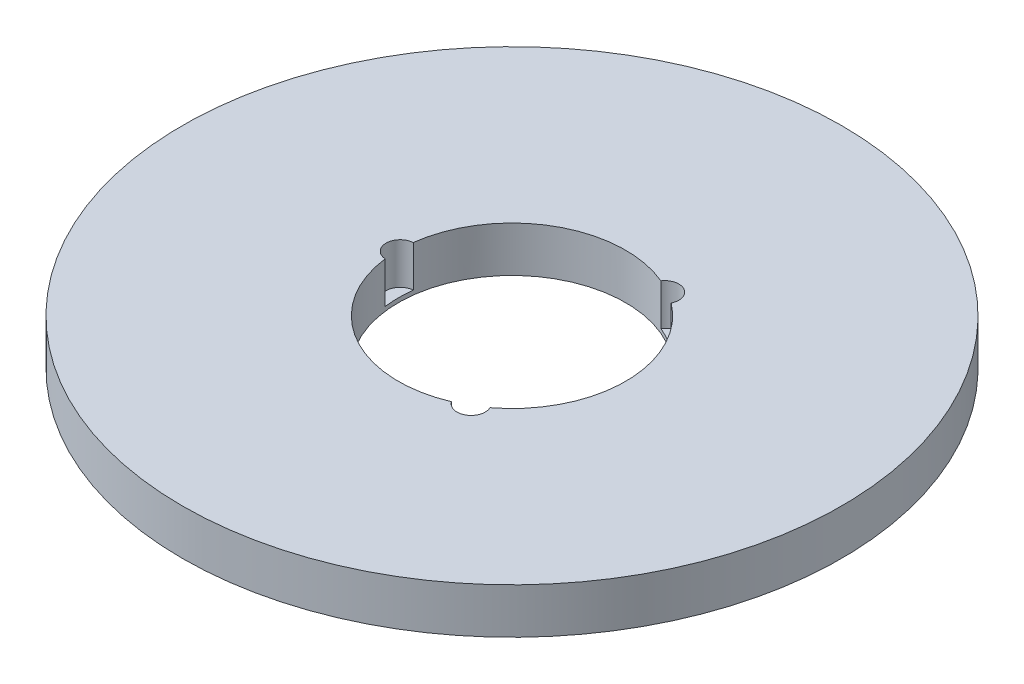
ISO-10303-21;
HEADER;
FILE_DESCRIPTION(('STEP AP214'),'2;1');
FILE_NAME('part.step','',(''),(''),'','','');
FILE_SCHEMA(('AUTOMOTIVE_DESIGN { 1 0 10303 214 1 1 1 1 }'));
ENDSEC;
DATA;
#1=APPLICATION_CONTEXT('core data for automotive mechanical design processes');
#2=APPLICATION_PROTOCOL_DEFINITION('international standard','automotive_design',2000,#1);
#3=PRODUCT_CONTEXT('',#1,'mechanical');
#4=PRODUCT('Part','Part','',(#3));
#5=PRODUCT_RELATED_PRODUCT_CATEGORY('part','',(#4));
#6=PRODUCT_DEFINITION_FORMATION('','',#4);
#7=PRODUCT_DEFINITION_CONTEXT('part definition',#1,'design');
#8=PRODUCT_DEFINITION('design','',#6,#7);
#9=PRODUCT_DEFINITION_SHAPE('','',#8);
#10=(LENGTH_UNIT() NAMED_UNIT(*) SI_UNIT(.MILLI.,.METRE.));
#11=(NAMED_UNIT(*) PLANE_ANGLE_UNIT() SI_UNIT($,.RADIAN.));
#12=(NAMED_UNIT(*) SI_UNIT($,.STERADIAN.) SOLID_ANGLE_UNIT());
#13=UNCERTAINTY_MEASURE_WITH_UNIT(LENGTH_MEASURE(1.E-05),#10,'distance_accuracy_value','');
#14=(GEOMETRIC_REPRESENTATION_CONTEXT(3) GLOBAL_UNCERTAINTY_ASSIGNED_CONTEXT((#13)) GLOBAL_UNIT_ASSIGNED_CONTEXT((#10,
#11,#12)) REPRESENTATION_CONTEXT('',''));
#15=CARTESIAN_POINT('',(0.,0.,0.));
#16=DIRECTION('',(0.,0.,1.));
#17=DIRECTION('',(1.,0.,0.));
#18=AXIS2_PLACEMENT_3D('',#15,#16,#17);
#19=CARTESIAN_POINT('',(0.,10.,0.));
#20=DIRECTION('',(0.,-1.,0.));
#21=DIRECTION('',(0.,0.,-1.));
#22=AXIS2_PLACEMENT_3D('',#19,#20,#21);
#23=CYLINDRICAL_SURFACE('',#22,72.5);
#24=CARTESIAN_POINT('',(0.,10.,0.));
#25=DIRECTION('',(0.,1.,0.));
#26=DIRECTION('',(0.,0.,1.));
#27=AXIS2_PLACEMENT_3D('',#24,#25,#26);
#28=CIRCLE('',#27,72.5);
#29=CARTESIAN_POINT('',(0.,10.,72.5));
#30=VERTEX_POINT('',#29);
#31=EDGE_CURVE('E130',#30,#30,#28,.T.);
#32=ORIENTED_EDGE('',*,*,#31,.F.);
#33=EDGE_LOOP('',(#32));
#34=FACE_BOUND('',#33,.T.);
#35=CARTESIAN_POINT('',(0.,0.,0.));
#36=DIRECTION('',(0.,1.,0.));
#37=DIRECTION('',(0.,0.,1.));
#38=AXIS2_PLACEMENT_3D('',#35,#36,#37);
#39=CIRCLE('',#38,72.5);
#40=CARTESIAN_POINT('',(0.,0.,72.5));
#41=VERTEX_POINT('',#40);
#42=EDGE_CURVE('E117',#41,#41,#39,.T.);
#43=ORIENTED_EDGE('',*,*,#42,.T.);
#44=EDGE_LOOP('',(#43));
#45=FACE_BOUND('',#44,.T.);
#46=ADVANCED_FACE('F39',(#34,#45),#23,.T.);
#47=CARTESIAN_POINT('',(0.,10.,0.));
#48=DIRECTION('',(0.,1.,0.));
#49=DIRECTION('',(0.,0.,1.));
#50=AXIS2_PLACEMENT_3D('',#47,#48,#49);
#51=PLANE('',#50);
#52=CARTESIAN_POINT('',(12.295118006902,10.,21.295769073009));
#53=DIRECTION('',(0.,1.,0.));
#54=DIRECTION('',(0.866025403784436,0.,-0.500000000000004));
#55=AXIS2_PLACEMENT_3D('',#52,#53,#54);
#56=CIRCLE('',#55,3.10738609465101);
#57=CARTESIAN_POINT('',(9.7190245812546,10.,23.0334661132225));
#58=VERTEX_POINT('',#57);
#59=CARTESIAN_POINT('',(15.0880545006316,10.,19.933655243983));
#60=VERTEX_POINT('',#59);
#61=EDGE_CURVE('E148',#58,#60,#56,.T.);
#62=ORIENTED_EDGE('',*,*,#61,.F.);
#63=CARTESIAN_POINT('',(0.,10.,0.));
#64=DIRECTION('',(0.,1.,0.));
#65=DIRECTION('',(0.,0.,1.));
#66=AXIS2_PLACEMENT_3D('',#63,#64,#65);
#67=CIRCLE('',#66,25.);
#68=CARTESIAN_POINT('',(-24.807079081886,10.,3.09981086923947));
#69=VERTEX_POINT('',#68);
#70=EDGE_CURVE('E113',#69,#58,#67,.T.);
#71=ORIENTED_EDGE('',*,*,#70,.F.);
#72=CARTESIAN_POINT('',(-24.5902360138038,10.,0.));
#73=DIRECTION('',(0.,1.,0.));
#74=DIRECTION('',(0.,0.,1.));
#75=AXIS2_PLACEMENT_3D('',#72,#73,#74);
#76=CIRCLE('',#75,3.10738609465101);
#77=CARTESIAN_POINT('',(-24.807079081886,10.,-3.09981086923947));
#78=VERTEX_POINT('',#77);
#79=EDGE_CURVE('E125',#78,#69,#76,.T.);
#80=ORIENTED_EDGE('',*,*,#79,.F.);
#81=CARTESIAN_POINT('',(9.71902458125427,10.,-23.0334661132226));
#82=VERTEX_POINT('',#81);
#83=EDGE_CURVE('E107',#82,#78,#67,.T.);
#84=ORIENTED_EDGE('',*,*,#83,.F.);
#85=CARTESIAN_POINT('',(12.2951180069017,10.,-21.2957690730092));
#86=DIRECTION('',(0.,1.,0.));
#87=DIRECTION('',(-0.866025403784443,0.,-0.499999999999992));
#88=AXIS2_PLACEMENT_3D('',#85,#86,#87);
#89=CIRCLE('',#88,3.10738609465101);
#90=CARTESIAN_POINT('',(15.0880545006313,10.,-19.9336552439832));
#91=VERTEX_POINT('',#90);
#92=EDGE_CURVE('E95',#91,#82,#89,.T.);
#93=ORIENTED_EDGE('',*,*,#92,.F.);
#94=EDGE_CURVE('E106',#60,#91,#67,.T.);
#95=ORIENTED_EDGE('',*,*,#94,.F.);
#96=EDGE_LOOP('',(#62,#71,#80,#84,#93,#95));
#97=FACE_BOUND('',#96,.T.);
#98=ORIENTED_EDGE('',*,*,#31,.T.);
#99=EDGE_LOOP('',(#98));
#100=FACE_BOUND('',#99,.T.);
#101=ADVANCED_FACE('F102',(#97,#100),#51,.T.);
#102=CARTESIAN_POINT('',(0.,0.,0.));
#103=DIRECTION('',(0.,1.,0.));
#104=DIRECTION('',(0.,0.,1.));
#105=AXIS2_PLACEMENT_3D('',#102,#103,#104);
#106=PLANE('',#105);
#107=CARTESIAN_POINT('',(0.,0.,0.));
#108=DIRECTION('',(0.,1.,0.));
#109=DIRECTION('',(0.,0.,1.));
#110=AXIS2_PLACEMENT_3D('',#107,#108,#109);
#111=CIRCLE('',#110,25.);
#112=CARTESIAN_POINT('',(0.,0.,25.));
#113=VERTEX_POINT('',#112);
#114=EDGE_CURVE('E118',#113,#113,#111,.T.);
#115=ORIENTED_EDGE('',*,*,#114,.T.);
#116=EDGE_LOOP('',(#115));
#117=FACE_BOUND('',#116,.T.);
#118=ORIENTED_EDGE('',*,*,#42,.F.);
#119=EDGE_LOOP('',(#118));
#120=FACE_BOUND('',#119,.T.);
#121=ADVANCED_FACE('F161',(#117,#120),#106,.F.);
#122=CARTESIAN_POINT('',(0.,10.,0.));
#123=DIRECTION('',(0.,-1.,0.));
#124=DIRECTION('',(0.,0.,-1.));
#125=AXIS2_PLACEMENT_3D('',#122,#123,#124);
#126=CYLINDRICAL_SURFACE('',#125,25.);
#127=DIRECTION('',(0.,1.,0.));
#128=VECTOR('',#127,1.);
#129=CARTESIAN_POINT('',(9.71902458125459,5.46245991660253,23.0334661132225));
#130=LINE('',#129,#128);
#131=CARTESIAN_POINT('',(9.7190245812546,0.924919833205069,23.0334661132225));
#132=VERTEX_POINT('',#131);
#133=EDGE_CURVE('E11',#132,#58,#130,.T.);
#134=ORIENTED_EDGE('',*,*,#133,.F.);
#135=CARTESIAN_POINT('',(0.,0.924919833205069,0.));
#136=DIRECTION('',(0.,1.,0.));
#137=DIRECTION('',(0.,0.,1.));
#138=AXIS2_PLACEMENT_3D('',#135,#136,#137);
#139=CIRCLE('',#138,25.);
#140=CARTESIAN_POINT('',(15.0880545006316,0.924919833205069,19.933655243983));
#141=VERTEX_POINT('',#140);
#142=EDGE_CURVE('E100',#132,#141,#139,.T.);
#143=ORIENTED_EDGE('',*,*,#142,.T.);
#144=DIRECTION('',(0.,1.,0.));
#145=VECTOR('',#144,1.);
#146=CARTESIAN_POINT('',(15.0880545006316,5.46245991660253,19.933655243983));
#147=LINE('',#146,#145);
#148=EDGE_CURVE('E46',#60,#141,#147,.F.);
#149=ORIENTED_EDGE('',*,*,#148,.F.);
#150=ORIENTED_EDGE('',*,*,#94,.T.);
#151=DIRECTION('',(0.,1.,0.));
#152=VECTOR('',#151,1.);
#153=CARTESIAN_POINT('',(15.0880545006313,5.46245991660253,-19.9336552439832));
#154=LINE('',#153,#152);
#155=CARTESIAN_POINT('',(15.0880545006313,0.924919833205069,-19.9336552439832));
#156=VERTEX_POINT('',#155);
#157=EDGE_CURVE('E90',#156,#91,#154,.T.);
#158=ORIENTED_EDGE('',*,*,#157,.F.);
#159=CARTESIAN_POINT('',(0.,0.924919833205069,0.));
#160=DIRECTION('',(0.,1.,0.));
#161=DIRECTION('',(0.,0.,1.));
#162=AXIS2_PLACEMENT_3D('',#159,#160,#161);
#163=CIRCLE('',#162,25.);
#164=CARTESIAN_POINT('',(9.71902458125427,0.924919833205069,-23.0334661132226));
#165=VERTEX_POINT('',#164);
#166=EDGE_CURVE('E143',#156,#165,#163,.T.);
#167=ORIENTED_EDGE('',*,*,#166,.T.);
#168=DIRECTION('',(0.,1.,0.));
#169=VECTOR('',#168,1.);
#170=CARTESIAN_POINT('',(9.71902458125427,5.46245991660253,-23.0334661132226));
#171=LINE('',#170,#169);
#172=EDGE_CURVE('E98',#82,#165,#171,.F.);
#173=ORIENTED_EDGE('',*,*,#172,.F.);
#174=ORIENTED_EDGE('',*,*,#83,.T.);
#175=DIRECTION('',(0.,1.,0.));
#176=VECTOR('',#175,1.);
#177=CARTESIAN_POINT('',(-24.807079081886,5.46245991660253,-3.09981086923947));
#178=LINE('',#177,#176);
#179=CARTESIAN_POINT('',(-24.807079081886,0.924919833205069,-3.09981086923947));
#180=VERTEX_POINT('',#179);
#181=EDGE_CURVE('E137',#180,#78,#178,.T.);
#182=ORIENTED_EDGE('',*,*,#181,.F.);
#183=CARTESIAN_POINT('',(0.,0.924919833205069,0.));
#184=DIRECTION('',(0.,1.,0.));
#185=DIRECTION('',(0.,0.,1.));
#186=AXIS2_PLACEMENT_3D('',#183,#184,#185);
#187=CIRCLE('',#186,25.);
#188=CARTESIAN_POINT('',(-24.807079081886,0.924919833205069,3.09981086923947));
#189=VERTEX_POINT('',#188);
#190=EDGE_CURVE('E128',#180,#189,#187,.T.);
#191=ORIENTED_EDGE('',*,*,#190,.T.);
#192=DIRECTION('',(0.,1.,0.));
#193=VECTOR('',#192,1.);
#194=CARTESIAN_POINT('',(-24.807079081886,5.46245991660253,3.09981086923947));
#195=LINE('',#194,#193);
#196=EDGE_CURVE('E134',#69,#189,#195,.F.);
#197=ORIENTED_EDGE('',*,*,#196,.F.);
#198=ORIENTED_EDGE('',*,*,#70,.T.);
#199=EDGE_LOOP('',(#134,#143,#149,#150,#158,#167,#173,#174,#182,#191,#197,#198));
#200=FACE_BOUND('',#199,.T.);
#201=ORIENTED_EDGE('',*,*,#114,.F.);
#202=EDGE_LOOP('',(#201));
#203=FACE_BOUND('',#202,.T.);
#204=ADVANCED_FACE('F115',(#200,#203),#126,.F.);
#205=CARTESIAN_POINT('',(-24.5902360138038,0.924919833205069,0.));
#206=DIRECTION('',(0.,1.,0.));
#207=DIRECTION('',(0.,0.,1.));
#208=AXIS2_PLACEMENT_3D('',#205,#206,#207);
#209=CYLINDRICAL_SURFACE('',#208,3.10738609465101);
#210=ORIENTED_EDGE('',*,*,#181,.T.);
#211=ORIENTED_EDGE('',*,*,#79,.T.);
#212=ORIENTED_EDGE('',*,*,#196,.T.);
#213=CARTESIAN_POINT('',(-24.5902360138038,0.924919833205069,0.));
#214=DIRECTION('',(0.,1.,0.));
#215=DIRECTION('',(0.,0.,1.));
#216=AXIS2_PLACEMENT_3D('',#213,#214,#215);
#217=CIRCLE('',#216,3.10738609465101);
#218=EDGE_CURVE('E127',#180,#189,#217,.T.);
#219=ORIENTED_EDGE('',*,*,#218,.F.);
#220=EDGE_LOOP('',(#210,#211,#212,#219));
#221=FACE_BOUND('',#220,.T.);
#222=ADVANCED_FACE('F175',(#221),#209,.F.);
#223=CARTESIAN_POINT('',(-24.5902360138038,0.924919833205069,0.));
#224=DIRECTION('',(0.,1.,0.));
#225=DIRECTION('',(0.,0.,1.));
#226=AXIS2_PLACEMENT_3D('',#223,#224,#225);
#227=PLANE('',#226);
#228=ORIENTED_EDGE('',*,*,#218,.T.);
#229=ORIENTED_EDGE('',*,*,#190,.F.);
#230=EDGE_LOOP('',(#228,#229));
#231=FACE_BOUND('',#230,.T.);
#232=ADVANCED_FACE('F176',(#231),#227,.T.);
#233=CARTESIAN_POINT('',(12.2951180069017,0.924919833205069,-21.2957690730092));
#234=DIRECTION('',(0.,1.,0.));
#235=DIRECTION('',(0.,0.,1.));
#236=AXIS2_PLACEMENT_3D('',#233,#234,#235);
#237=CYLINDRICAL_SURFACE('',#236,3.10738609465101);
#238=ORIENTED_EDGE('',*,*,#157,.T.);
#239=ORIENTED_EDGE('',*,*,#92,.T.);
#240=ORIENTED_EDGE('',*,*,#172,.T.);
#241=CARTESIAN_POINT('',(12.2951180069017,0.924919833205069,-21.2957690730092));
#242=DIRECTION('',(0.,1.,0.));
#243=DIRECTION('',(-0.866025403784443,0.,-0.499999999999992));
#244=AXIS2_PLACEMENT_3D('',#241,#242,#243);
#245=CIRCLE('',#244,3.10738609465101);
#246=EDGE_CURVE('E56',#156,#165,#245,.T.);
#247=ORIENTED_EDGE('',*,*,#246,.F.);
#248=EDGE_LOOP('',(#238,#239,#240,#247));
#249=FACE_BOUND('',#248,.T.);
#250=ADVANCED_FACE('F93',(#249),#237,.F.);
#251=CARTESIAN_POINT('',(12.2951180069017,0.924919833205069,-21.2957690730092));
#252=DIRECTION('',(0.,1.,0.));
#253=DIRECTION('',(-0.866025403784443,0.,-0.499999999999992));
#254=AXIS2_PLACEMENT_3D('',#251,#252,#253);
#255=PLANE('',#254);
#256=ORIENTED_EDGE('',*,*,#246,.T.);
#257=ORIENTED_EDGE('',*,*,#166,.F.);
#258=EDGE_LOOP('',(#256,#257));
#259=FACE_BOUND('',#258,.T.);
#260=ADVANCED_FACE('F153',(#259),#255,.T.);
#261=CARTESIAN_POINT('',(12.295118006902,0.924919833205069,21.295769073009));
#262=DIRECTION('',(0.,1.,0.));
#263=DIRECTION('',(0.,0.,1.));
#264=AXIS2_PLACEMENT_3D('',#261,#262,#263);
#265=CYLINDRICAL_SURFACE('',#264,3.10738609465101);
#266=ORIENTED_EDGE('',*,*,#133,.T.);
#267=ORIENTED_EDGE('',*,*,#61,.T.);
#268=ORIENTED_EDGE('',*,*,#148,.T.);
#269=CARTESIAN_POINT('',(12.295118006902,0.924919833205069,21.295769073009));
#270=DIRECTION('',(0.,1.,0.));
#271=DIRECTION('',(0.866025403784436,0.,-0.500000000000004));
#272=AXIS2_PLACEMENT_3D('',#269,#270,#271);
#273=CIRCLE('',#272,3.10738609465101);
#274=EDGE_CURVE('E55',#132,#141,#273,.T.);
#275=ORIENTED_EDGE('',*,*,#274,.F.);
#276=EDGE_LOOP('',(#266,#267,#268,#275));
#277=FACE_BOUND('',#276,.T.);
#278=ADVANCED_FACE('F144',(#277),#265,.F.);
#279=CARTESIAN_POINT('',(12.295118006902,0.924919833205069,21.295769073009));
#280=DIRECTION('',(0.,1.,0.));
#281=DIRECTION('',(0.866025403784436,0.,-0.500000000000004));
#282=AXIS2_PLACEMENT_3D('',#279,#280,#281);
#283=PLANE('',#282);
#284=ORIENTED_EDGE('',*,*,#274,.T.);
#285=ORIENTED_EDGE('',*,*,#142,.F.);
#286=EDGE_LOOP('',(#284,#285));
#287=FACE_BOUND('',#286,.T.);
#288=ADVANCED_FACE('F150',(#287),#283,.T.);
#289=CLOSED_SHELL('',(#46,#101,#121,#204,#222,#232,#250,#260,#278,#288));
#290=MANIFOLD_SOLID_BREP('B2',#289);
#291=ADVANCED_BREP_SHAPE_REPRESENTATION('',(#18,#290),#14);
#292=SHAPE_DEFINITION_REPRESENTATION(#9,#291);
ENDSEC;
END-ISO-10303-21;
